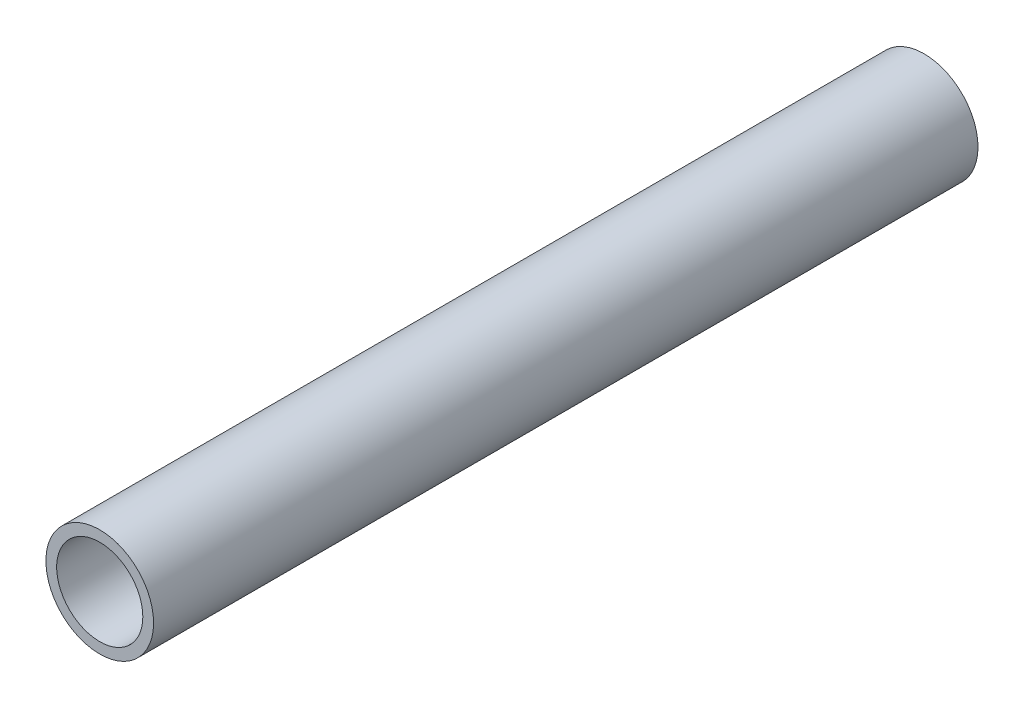
ISO-10303-21;
HEADER;
FILE_DESCRIPTION(('STEP AP214'),'2;1');
FILE_NAME('part.step','',(''),(''),'','','');
FILE_SCHEMA(('AUTOMOTIVE_DESIGN { 1 0 10303 214 1 1 1 1 }'));
ENDSEC;
DATA;
#1=APPLICATION_CONTEXT('core data for automotive mechanical design processes');
#2=APPLICATION_PROTOCOL_DEFINITION('international standard','automotive_design',2000,#1);
#3=PRODUCT_CONTEXT('',#1,'mechanical');
#4=PRODUCT('Part','Part','',(#3));
#5=PRODUCT_RELATED_PRODUCT_CATEGORY('part','',(#4));
#6=PRODUCT_DEFINITION_FORMATION('','',#4);
#7=PRODUCT_DEFINITION_CONTEXT('part definition',#1,'design');
#8=PRODUCT_DEFINITION('design','',#6,#7);
#9=PRODUCT_DEFINITION_SHAPE('','',#8);
#10=(LENGTH_UNIT() NAMED_UNIT(*) SI_UNIT(.MILLI.,.METRE.));
#11=(NAMED_UNIT(*) PLANE_ANGLE_UNIT() SI_UNIT($,.RADIAN.));
#12=(NAMED_UNIT(*) SI_UNIT($,.STERADIAN.) SOLID_ANGLE_UNIT());
#13=UNCERTAINTY_MEASURE_WITH_UNIT(LENGTH_MEASURE(1.E-05),#10,'distance_accuracy_value','');
#14=(GEOMETRIC_REPRESENTATION_CONTEXT(3) GLOBAL_UNCERTAINTY_ASSIGNED_CONTEXT((#13)) GLOBAL_UNIT_ASSIGNED_CONTEXT((#10,
#11,#12)) REPRESENTATION_CONTEXT('',''));
#15=CARTESIAN_POINT('',(0.,0.,0.));
#16=DIRECTION('',(0.,0.,1.));
#17=DIRECTION('',(1.,0.,0.));
#18=AXIS2_PLACEMENT_3D('',#15,#16,#17);
#19=CARTESIAN_POINT('',(0.,0.,19.14));
#20=DIRECTION('',(0.,0.,1.));
#21=DIRECTION('',(1.,0.,0.));
#22=AXIS2_PLACEMENT_3D('',#19,#20,#21);
#23=PLANE('',#22);
#24=CARTESIAN_POINT('',(0.,0.,19.14));
#25=DIRECTION('',(0.,0.,1.));
#26=DIRECTION('',(1.,0.,0.));
#27=AXIS2_PLACEMENT_3D('',#24,#25,#26);
#28=CIRCLE('',#27,1.25);
#29=CARTESIAN_POINT('',(1.25,0.,19.14));
#30=VERTEX_POINT('',#29);
#31=EDGE_CURVE('E10',#30,#30,#28,.T.);
#32=ORIENTED_EDGE('',*,*,#31,.T.);
#33=EDGE_LOOP('',(#32));
#34=FACE_BOUND('',#33,.T.);
#35=CARTESIAN_POINT('',(0.,0.,19.14));
#36=DIRECTION('',(0.,0.,1.));
#37=DIRECTION('',(1.,0.,0.));
#38=AXIS2_PLACEMENT_3D('',#35,#36,#37);
#39=CIRCLE('',#38,1.);
#40=CARTESIAN_POINT('',(1.,0.,19.14));
#41=VERTEX_POINT('',#40);
#42=EDGE_CURVE('E41',#41,#41,#39,.T.);
#43=ORIENTED_EDGE('',*,*,#42,.F.);
#44=EDGE_LOOP('',(#43));
#45=FACE_BOUND('',#44,.T.);
#46=ADVANCED_FACE('F30',(#34,#45),#23,.T.);
#47=CARTESIAN_POINT('',(0.,0.,0.));
#48=DIRECTION('',(0.,0.,1.));
#49=DIRECTION('',(1.,0.,0.));
#50=AXIS2_PLACEMENT_3D('',#47,#48,#49);
#51=PLANE('',#50);
#52=CARTESIAN_POINT('',(0.,0.,0.));
#53=DIRECTION('',(0.,0.,1.));
#54=DIRECTION('',(1.,0.,0.));
#55=AXIS2_PLACEMENT_3D('',#52,#53,#54);
#56=CIRCLE('',#55,1.25);
#57=CARTESIAN_POINT('',(1.25,0.,0.));
#58=VERTEX_POINT('',#57);
#59=EDGE_CURVE('E34',#58,#58,#56,.T.);
#60=ORIENTED_EDGE('',*,*,#59,.F.);
#61=EDGE_LOOP('',(#60));
#62=FACE_BOUND('',#61,.T.);
#63=CARTESIAN_POINT('',(0.,0.,0.));
#64=DIRECTION('',(0.,0.,1.));
#65=DIRECTION('',(1.,0.,0.));
#66=AXIS2_PLACEMENT_3D('',#63,#64,#65);
#67=CIRCLE('',#66,1.);
#68=CARTESIAN_POINT('',(1.,0.,0.));
#69=VERTEX_POINT('',#68);
#70=EDGE_CURVE('E43',#69,#69,#67,.T.);
#71=ORIENTED_EDGE('',*,*,#70,.T.);
#72=EDGE_LOOP('',(#71));
#73=FACE_BOUND('',#72,.T.);
#74=ADVANCED_FACE('F53',(#62,#73),#51,.F.);
#75=CARTESIAN_POINT('',(0.,0.,19.14));
#76=DIRECTION('',(0.,0.,-1.));
#77=DIRECTION('',(-1.,0.,0.));
#78=AXIS2_PLACEMENT_3D('',#75,#76,#77);
#79=CYLINDRICAL_SURFACE('',#78,1.25);
#80=ORIENTED_EDGE('',*,*,#31,.F.);
#81=EDGE_LOOP('',(#80));
#82=FACE_BOUND('',#81,.T.);
#83=ORIENTED_EDGE('',*,*,#59,.T.);
#84=EDGE_LOOP('',(#83));
#85=FACE_BOUND('',#84,.T.);
#86=ADVANCED_FACE('F32',(#82,#85),#79,.T.);
#87=CARTESIAN_POINT('',(0.,0.,19.14));
#88=DIRECTION('',(0.,0.,-1.));
#89=DIRECTION('',(-1.,0.,0.));
#90=AXIS2_PLACEMENT_3D('',#87,#88,#89);
#91=CYLINDRICAL_SURFACE('',#90,1.);
#92=ORIENTED_EDGE('',*,*,#42,.T.);
#93=EDGE_LOOP('',(#92));
#94=FACE_BOUND('',#93,.T.);
#95=ORIENTED_EDGE('',*,*,#70,.F.);
#96=EDGE_LOOP('',(#95));
#97=FACE_BOUND('',#96,.T.);
#98=ADVANCED_FACE('F49',(#94,#97),#91,.F.);
#99=CLOSED_SHELL('',(#46,#74,#86,#98));
#100=MANIFOLD_SOLID_BREP('B2',#99);
#101=ADVANCED_BREP_SHAPE_REPRESENTATION('',(#18,#100),#14);
#102=SHAPE_DEFINITION_REPRESENTATION(#9,#101);
ENDSEC;
END-ISO-10303-21;
